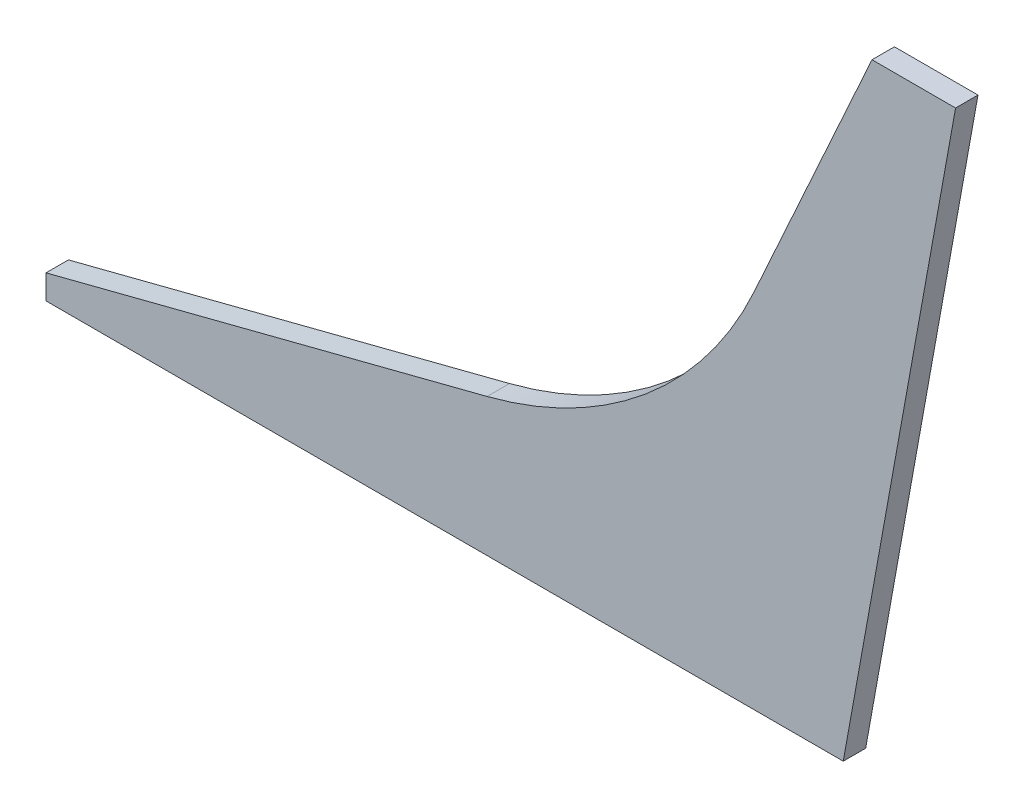
ISO-10303-21;
HEADER;
FILE_DESCRIPTION(('STEP AP214'),'2;1');
FILE_NAME('part.step','',(''),(''),'','','');
FILE_SCHEMA(('AUTOMOTIVE_DESIGN { 1 0 10303 214 1 1 1 1 }'));
ENDSEC;
DATA;
#1=APPLICATION_CONTEXT('core data for automotive mechanical design processes');
#2=APPLICATION_PROTOCOL_DEFINITION('international standard','automotive_design',2000,#1);
#3=PRODUCT_CONTEXT('',#1,'mechanical');
#4=PRODUCT('Part','Part','',(#3));
#5=PRODUCT_RELATED_PRODUCT_CATEGORY('part','',(#4));
#6=PRODUCT_DEFINITION_FORMATION('','',#4);
#7=PRODUCT_DEFINITION_CONTEXT('part definition',#1,'design');
#8=PRODUCT_DEFINITION('design','',#6,#7);
#9=PRODUCT_DEFINITION_SHAPE('','',#8);
#10=(LENGTH_UNIT() NAMED_UNIT(*) SI_UNIT(.MILLI.,.METRE.));
#11=(NAMED_UNIT(*) PLANE_ANGLE_UNIT() SI_UNIT($,.RADIAN.));
#12=(NAMED_UNIT(*) SI_UNIT($,.STERADIAN.) SOLID_ANGLE_UNIT());
#13=UNCERTAINTY_MEASURE_WITH_UNIT(LENGTH_MEASURE(1.E-05),#10,'distance_accuracy_value','');
#14=(GEOMETRIC_REPRESENTATION_CONTEXT(3) GLOBAL_UNCERTAINTY_ASSIGNED_CONTEXT((#13)) GLOBAL_UNIT_ASSIGNED_CONTEXT((#10,
#11,#12)) REPRESENTATION_CONTEXT('',''));
#15=CARTESIAN_POINT('',(0.,0.,0.));
#16=DIRECTION('',(0.,0.,1.));
#17=DIRECTION('',(1.,0.,0.));
#18=AXIS2_PLACEMENT_3D('',#15,#16,#17);
#19=CARTESIAN_POINT('',(396.730398778615,416.,15.));
#20=DIRECTION('',(0.,-1.,0.));
#21=DIRECTION('',(0.,0.,-1.));
#22=AXIS2_PLACEMENT_3D('',#19,#20,#21);
#23=PLANE('',#22);
#24=DIRECTION('',(-1.,0.,0.));
#25=VECTOR('',#24,1.);
#26=CARTESIAN_POINT('',(396.730398778615,416.,15.));
#27=LINE('',#26,#25);
#28=CARTESIAN_POINT('',(371.734942748036,416.,15.));
#29=VERTEX_POINT('',#28);
#30=CARTESIAN_POINT('',(315.832809595219,416.,15.));
#31=VERTEX_POINT('',#30);
#32=EDGE_CURVE('E89',#29,#31,#27,.T.);
#33=ORIENTED_EDGE('',*,*,#32,.F.);
#34=DIRECTION('',(0.,0.,1.));
#35=VECTOR('',#34,1.);
#36=CARTESIAN_POINT('',(371.734942748036,416.,0.));
#37=LINE('',#36,#35);
#38=CARTESIAN_POINT('',(371.734942748036,416.,0.));
#39=VERTEX_POINT('',#38);
#40=EDGE_CURVE('E151',#39,#29,#37,.T.);
#41=ORIENTED_EDGE('',*,*,#40,.F.);
#42=DIRECTION('',(-1.,0.,0.));
#43=VECTOR('',#42,1.);
#44=CARTESIAN_POINT('',(396.730398778615,416.,0.));
#45=LINE('',#44,#43);
#46=CARTESIAN_POINT('',(315.832809595219,416.,0.));
#47=VERTEX_POINT('',#46);
#48=EDGE_CURVE('E125',#39,#47,#45,.T.);
#49=ORIENTED_EDGE('',*,*,#48,.T.);
#50=DIRECTION('',(0.,0.,-1.));
#51=VECTOR('',#50,1.);
#52=CARTESIAN_POINT('',(315.832809595219,416.,15.));
#53=LINE('',#52,#51);
#54=EDGE_CURVE('E11',#31,#47,#53,.T.);
#55=ORIENTED_EDGE('',*,*,#54,.F.);
#56=EDGE_LOOP('',(#33,#41,#49,#55));
#57=FACE_BOUND('',#56,.T.);
#58=ADVANCED_FACE('F33',(#57),#23,.F.);
#59=CARTESIAN_POINT('',(315.832809595219,416.,15.));
#60=DIRECTION('',(0.910712499489341,-0.413040849400973,0.));
#61=DIRECTION('',(0.413040849400973,0.910712499489341,0.));
#62=AXIS2_PLACEMENT_3D('',#59,#60,#61);
#63=PLANE('',#62);
#64=DIRECTION('',(-0.413040849400973,-0.910712499489341,0.));
#65=VECTOR('',#64,1.);
#66=CARTESIAN_POINT('',(315.832809595219,416.,0.));
#67=LINE('',#66,#65);
#68=CARTESIAN_POINT('',(236.983089551291,242.144494595668,0.));
#69=VERTEX_POINT('',#68);
#70=EDGE_CURVE('E127',#47,#69,#67,.T.);
#71=ORIENTED_EDGE('',*,*,#70,.T.);
#72=DIRECTION('',(0.,0.,-1.));
#73=VECTOR('',#72,1.);
#74=CARTESIAN_POINT('',(236.983089551291,242.144494595668,15.));
#75=LINE('',#74,#73);
#76=CARTESIAN_POINT('',(236.983089551291,242.144494595668,15.));
#77=VERTEX_POINT('',#76);
#78=EDGE_CURVE('E40',#77,#69,#75,.T.);
#79=ORIENTED_EDGE('',*,*,#78,.F.);
#80=DIRECTION('',(-0.413040849400973,-0.910712499489341,0.));
#81=VECTOR('',#80,1.);
#82=CARTESIAN_POINT('',(315.832809595219,416.,15.));
#83=LINE('',#82,#81);
#84=EDGE_CURVE('E103',#31,#77,#83,.T.);
#85=ORIENTED_EDGE('',*,*,#84,.F.);
#86=ORIENTED_EDGE('',*,*,#54,.T.);
#87=EDGE_LOOP('',(#71,#79,#85,#86));
#88=FACE_BOUND('',#87,.T.);
#89=ADVANCED_FACE('F168',(#88),#63,.F.);
#90=CARTESIAN_POINT('',(-8.90928531083155,353.66552393393,15.));
#91=DIRECTION('',(0.,0.,-1.));
#92=DIRECTION('',(-1.,0.,0.));
#93=AXIS2_PLACEMENT_3D('',#90,#91,#92);
#94=CYLINDRICAL_SURFACE('',#93,270.);
#95=CARTESIAN_POINT('',(-8.90928531083155,353.66552393393,0.));
#96=DIRECTION('',(0.,0.,-1.));
#97=DIRECTION('',(-1.,0.,0.));
#98=AXIS2_PLACEMENT_3D('',#95,#96,#97);
#99=CIRCLE('',#98,270.);
#100=CARTESIAN_POINT('',(58.3523087345649,92.1777078382808,0.));
#101=VERTEX_POINT('',#100);
#102=EDGE_CURVE('E112',#69,#101,#99,.T.);
#103=ORIENTED_EDGE('',*,*,#102,.T.);
#104=DIRECTION('',(0.,0.,-1.));
#105=VECTOR('',#104,1.);
#106=CARTESIAN_POINT('',(58.3523087345649,92.1777078382808,15.));
#107=LINE('',#106,#105);
#108=CARTESIAN_POINT('',(58.3523087345649,92.1777078382808,15.));
#109=VERTEX_POINT('',#108);
#110=EDGE_CURVE('E109',#109,#101,#107,.T.);
#111=ORIENTED_EDGE('',*,*,#110,.F.);
#112=CARTESIAN_POINT('',(-8.90928531083155,353.66552393393,15.));
#113=DIRECTION('',(0.,0.,-1.));
#114=DIRECTION('',(-1.,0.,0.));
#115=AXIS2_PLACEMENT_3D('',#112,#113,#114);
#116=CIRCLE('',#115,270.);
#117=EDGE_CURVE('E96',#77,#109,#116,.T.);
#118=ORIENTED_EDGE('',*,*,#117,.F.);
#119=ORIENTED_EDGE('',*,*,#78,.T.);
#120=EDGE_LOOP('',(#103,#111,#118,#119));
#121=FACE_BOUND('',#120,.T.);
#122=ADVANCED_FACE('F110',(#121),#94,.F.);
#123=CARTESIAN_POINT('',(58.3523087345649,92.1777078382808,15.));
#124=DIRECTION('',(0.24911701498295,-0.96847339294685,0.));
#125=DIRECTION('',(0.968473392946851,0.24911701498295,0.));
#126=AXIS2_PLACEMENT_3D('',#123,#124,#125);
#127=PLANE('',#126);
#128=DIRECTION('',(-0.968473392946851,-0.24911701498295,0.));
#129=VECTOR('',#128,1.);
#130=CARTESIAN_POINT('',(58.3523087345649,92.1777078382808,0.));
#131=LINE('',#130,#129);
#132=CARTESIAN_POINT('',(-236.729376995966,16.2748805012772,0.));
#133=VERTEX_POINT('',#132);
#134=EDGE_CURVE('E131',#101,#133,#131,.T.);
#135=ORIENTED_EDGE('',*,*,#134,.T.);
#136=DIRECTION('',(0.,0.,-1.));
#137=VECTOR('',#136,1.);
#138=CARTESIAN_POINT('',(-236.729376995966,16.2748805012772,15.));
#139=LINE('',#138,#137);
#140=CARTESIAN_POINT('',(-236.729376995966,16.2748805012772,15.));
#141=VERTEX_POINT('',#140);
#142=EDGE_CURVE('E115',#141,#133,#139,.T.);
#143=ORIENTED_EDGE('',*,*,#142,.F.);
#144=DIRECTION('',(-0.968473392946851,-0.24911701498295,0.));
#145=VECTOR('',#144,1.);
#146=CARTESIAN_POINT('',(58.3523087345649,92.1777078382808,15.));
#147=LINE('',#146,#145);
#148=EDGE_CURVE('E100',#109,#141,#147,.T.);
#149=ORIENTED_EDGE('',*,*,#148,.F.);
#150=ORIENTED_EDGE('',*,*,#110,.T.);
#151=EDGE_LOOP('',(#135,#143,#149,#150));
#152=FACE_BOUND('',#151,.T.);
#153=ADVANCED_FACE('F117',(#152),#127,.F.);
#154=CARTESIAN_POINT('',(-236.729376995966,16.2748805012772,15.));
#155=DIRECTION('',(1.,0.,0.));
#156=DIRECTION('',(0.,0.,-1.));
#157=AXIS2_PLACEMENT_3D('',#154,#155,#156);
#158=PLANE('',#157);
#159=DIRECTION('',(0.,-1.,0.));
#160=VECTOR('',#159,1.);
#161=CARTESIAN_POINT('',(-236.729376995966,16.2748805012772,0.));
#162=LINE('',#161,#160);
#163=CARTESIAN_POINT('',(-236.729376995966,0.,0.));
#164=VERTEX_POINT('',#163);
#165=EDGE_CURVE('E81',#133,#164,#162,.T.);
#166=ORIENTED_EDGE('',*,*,#165,.T.);
#167=DIRECTION('',(0.,0.,-1.));
#168=VECTOR('',#167,1.);
#169=CARTESIAN_POINT('',(-236.729376995966,0.,15.));
#170=LINE('',#169,#168);
#171=CARTESIAN_POINT('',(-236.729376995966,0.,15.));
#172=VERTEX_POINT('',#171);
#173=EDGE_CURVE('E121',#172,#164,#170,.T.);
#174=ORIENTED_EDGE('',*,*,#173,.F.);
#175=DIRECTION('',(0.,-1.,0.));
#176=VECTOR('',#175,1.);
#177=CARTESIAN_POINT('',(-236.729376995966,16.2748805012772,15.));
#178=LINE('',#177,#176);
#179=EDGE_CURVE('E119',#141,#172,#178,.T.);
#180=ORIENTED_EDGE('',*,*,#179,.F.);
#181=ORIENTED_EDGE('',*,*,#142,.T.);
#182=EDGE_LOOP('',(#166,#174,#180,#181));
#183=FACE_BOUND('',#182,.T.);
#184=ADVANCED_FACE('F144',(#183),#158,.F.);
#185=CARTESIAN_POINT('',(-236.729376995966,0.,15.));
#186=DIRECTION('',(0.,1.,0.));
#187=DIRECTION('',(-1.,0.,0.));
#188=AXIS2_PLACEMENT_3D('',#185,#186,#187);
#189=PLANE('',#188);
#190=DIRECTION('',(1.,0.,0.));
#191=VECTOR('',#190,1.);
#192=CARTESIAN_POINT('',(-236.729376995966,0.,0.));
#193=LINE('',#192,#191);
#194=CARTESIAN_POINT('',(296.597151768925,0.,0.));
#195=VERTEX_POINT('',#194);
#196=EDGE_CURVE('E134',#164,#195,#193,.T.);
#197=ORIENTED_EDGE('',*,*,#196,.T.);
#198=DIRECTION('',(0.,0.,1.));
#199=VECTOR('',#198,1.);
#200=CARTESIAN_POINT('',(296.597151768925,0.,0.));
#201=LINE('',#200,#199);
#202=CARTESIAN_POINT('',(296.597151768925,0.,15.));
#203=VERTEX_POINT('',#202);
#204=EDGE_CURVE('E47',#195,#203,#201,.T.);
#205=ORIENTED_EDGE('',*,*,#204,.T.);
#206=DIRECTION('',(1.,0.,0.));
#207=VECTOR('',#206,1.);
#208=CARTESIAN_POINT('',(0.,0.,15.));
#209=LINE('',#208,#207);
#210=EDGE_CURVE('E55',#172,#203,#209,.T.);
#211=ORIENTED_EDGE('',*,*,#210,.F.);
#212=ORIENTED_EDGE('',*,*,#173,.T.);
#213=EDGE_LOOP('',(#197,#205,#211,#212));
#214=FACE_BOUND('',#213,.T.);
#215=ADVANCED_FACE('F157',(#214),#189,.F.);
#216=CARTESIAN_POINT('',(-8.90928531083155,353.66552393393,15.));
#217=DIRECTION('',(0.,0.,-1.));
#218=DIRECTION('',(-1.,0.,0.));
#219=AXIS2_PLACEMENT_3D('',#216,#217,#218);
#220=PLANE('',#219);
#221=ORIENTED_EDGE('',*,*,#210,.T.);
#222=DIRECTION('',(0.177743650661851,0.984076823550579,0.));
#223=VECTOR('',#222,1.);
#224=CARTESIAN_POINT('',(348.80618815154,289.055066061312,15.));
#225=LINE('',#224,#223);
#226=EDGE_CURVE('E128',#203,#29,#225,.T.);
#227=ORIENTED_EDGE('',*,*,#226,.T.);
#228=ORIENTED_EDGE('',*,*,#32,.T.);
#229=ORIENTED_EDGE('',*,*,#84,.T.);
#230=ORIENTED_EDGE('',*,*,#117,.T.);
#231=ORIENTED_EDGE('',*,*,#148,.T.);
#232=ORIENTED_EDGE('',*,*,#179,.T.);
#233=EDGE_LOOP('',(#221,#227,#228,#229,#230,#231,#232));
#234=FACE_BOUND('',#233,.T.);
#235=ADVANCED_FACE('F98',(#234),#220,.F.);
#236=CARTESIAN_POINT('',(-8.90928531083155,353.66552393393,0.));
#237=DIRECTION('',(0.,0.,-1.));
#238=DIRECTION('',(-1.,0.,0.));
#239=AXIS2_PLACEMENT_3D('',#236,#237,#238);
#240=PLANE('',#239);
#241=DIRECTION('',(-0.177743650661851,-0.984076823550579,0.));
#242=VECTOR('',#241,1.);
#243=CARTESIAN_POINT('',(296.597151768925,0.,0.));
#244=LINE('',#243,#242);
#245=EDGE_CURVE('E154',#39,#195,#244,.T.);
#246=ORIENTED_EDGE('',*,*,#245,.T.);
#247=ORIENTED_EDGE('',*,*,#196,.F.);
#248=ORIENTED_EDGE('',*,*,#165,.F.);
#249=ORIENTED_EDGE('',*,*,#134,.F.);
#250=ORIENTED_EDGE('',*,*,#102,.F.);
#251=ORIENTED_EDGE('',*,*,#70,.F.);
#252=ORIENTED_EDGE('',*,*,#48,.F.);
#253=EDGE_LOOP('',(#246,#247,#248,#249,#250,#251,#252));
#254=FACE_BOUND('',#253,.T.);
#255=ADVANCED_FACE('F141',(#254),#240,.T.);
#256=CARTESIAN_POINT('',(296.597151768925,0.,0.));
#257=DIRECTION('',(-0.984076823550579,0.177743650661851,0.));
#258=DIRECTION('',(-0.177743650661851,-0.984076823550579,0.));
#259=AXIS2_PLACEMENT_3D('',#256,#257,#258);
#260=PLANE('',#259);
#261=ORIENTED_EDGE('',*,*,#204,.F.);
#262=ORIENTED_EDGE('',*,*,#245,.F.);
#263=ORIENTED_EDGE('',*,*,#40,.T.);
#264=ORIENTED_EDGE('',*,*,#226,.F.);
#265=EDGE_LOOP('',(#261,#262,#263,#264));
#266=FACE_BOUND('',#265,.T.);
#267=ADVANCED_FACE('F174',(#266),#260,.F.);
#268=CLOSED_SHELL('',(#58,#89,#122,#153,#184,#215,#235,#255,#267));
#269=MANIFOLD_SOLID_BREP('B2',#268);
#270=ADVANCED_BREP_SHAPE_REPRESENTATION('',(#18,#269),#14);
#271=SHAPE_DEFINITION_REPRESENTATION(#9,#270);
ENDSEC;
END-ISO-10303-21;
